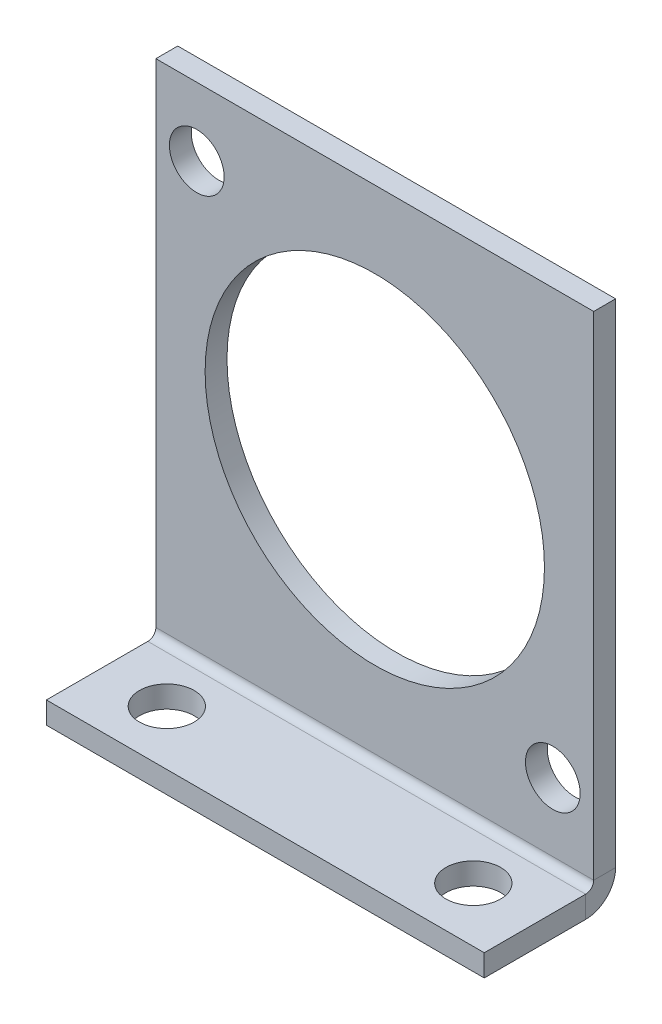
ISO-10303-21;
HEADER;
FILE_DESCRIPTION(('STEP AP214'),'2;1');
FILE_NAME('part.step','',(''),(''),'','','');
FILE_SCHEMA(('AUTOMOTIVE_DESIGN { 1 0 10303 214 1 1 1 1 }'));
ENDSEC;
DATA;
#1=APPLICATION_CONTEXT('core data for automotive mechanical design processes');
#2=APPLICATION_PROTOCOL_DEFINITION('international standard','automotive_design',2000,#1);
#3=PRODUCT_CONTEXT('',#1,'mechanical');
#4=PRODUCT('Part','Part','',(#3));
#5=PRODUCT_RELATED_PRODUCT_CATEGORY('part','',(#4));
#6=PRODUCT_DEFINITION_FORMATION('','',#4);
#7=PRODUCT_DEFINITION_CONTEXT('part definition',#1,'design');
#8=PRODUCT_DEFINITION('design','',#6,#7);
#9=PRODUCT_DEFINITION_SHAPE('','',#8);
#10=(LENGTH_UNIT() NAMED_UNIT(*) SI_UNIT(.MILLI.,.METRE.));
#11=(NAMED_UNIT(*) PLANE_ANGLE_UNIT() SI_UNIT($,.RADIAN.));
#12=(NAMED_UNIT(*) SI_UNIT($,.STERADIAN.) SOLID_ANGLE_UNIT());
#13=UNCERTAINTY_MEASURE_WITH_UNIT(LENGTH_MEASURE(1.E-05),#10,'distance_accuracy_value','');
#14=(GEOMETRIC_REPRESENTATION_CONTEXT(3) GLOBAL_UNCERTAINTY_ASSIGNED_CONTEXT((#13)) GLOBAL_UNIT_ASSIGNED_CONTEXT((#10,
#11,#12)) REPRESENTATION_CONTEXT('',''));
#15=CARTESIAN_POINT('',(0.,0.,0.));
#16=DIRECTION('',(0.,0.,1.));
#17=DIRECTION('',(1.,0.,0.));
#18=AXIS2_PLACEMENT_3D('',#15,#16,#17);
#19=CARTESIAN_POINT('',(20.,22.5,-2.));
#20=DIRECTION('',(1.,0.,0.));
#21=DIRECTION('',(0.,1.,0.));
#22=AXIS2_PLACEMENT_3D('',#19,#20,#21);
#23=PLANE('',#22);
#24=DIRECTION('',(0.,1.,0.));
#25=VECTOR('',#24,1.);
#26=CARTESIAN_POINT('',(20.,22.5,0.));
#27=LINE('',#26,#25);
#28=CARTESIAN_POINT('',(20.,-22.5,0.));
#29=VERTEX_POINT('',#28);
#30=CARTESIAN_POINT('',(20.,22.5,0.));
#31=VERTEX_POINT('',#30);
#32=EDGE_CURVE('E105',#29,#31,#27,.T.);
#33=ORIENTED_EDGE('',*,*,#32,.F.);
#34=DIRECTION('',(0.,0.,1.));
#35=VECTOR('',#34,1.);
#36=CARTESIAN_POINT('',(20.,-22.5,-2.));
#37=LINE('',#36,#35);
#38=CARTESIAN_POINT('',(20.,-22.5,-2.));
#39=VERTEX_POINT('',#38);
#40=EDGE_CURVE('E13',#39,#29,#37,.T.);
#41=ORIENTED_EDGE('',*,*,#40,.F.);
#42=DIRECTION('',(0.,1.,0.));
#43=VECTOR('',#42,1.);
#44=CARTESIAN_POINT('',(20.,22.5,-2.));
#45=LINE('',#44,#43);
#46=CARTESIAN_POINT('',(20.,22.5,-2.));
#47=VERTEX_POINT('',#46);
#48=EDGE_CURVE('E240',#39,#47,#45,.T.);
#49=ORIENTED_EDGE('',*,*,#48,.T.);
#50=DIRECTION('',(0.,0.,1.));
#51=VECTOR('',#50,1.);
#52=CARTESIAN_POINT('',(20.,22.5,-2.));
#53=LINE('',#52,#51);
#54=EDGE_CURVE('E111',#47,#31,#53,.T.);
#55=ORIENTED_EDGE('',*,*,#54,.T.);
#56=EDGE_LOOP('',(#33,#41,#49,#55));
#57=FACE_BOUND('',#56,.T.);
#58=ADVANCED_FACE('F66',(#57),#23,.T.);
#59=CARTESIAN_POINT('',(-20.,22.5,-2.));
#60=DIRECTION('',(-1.,0.,0.));
#61=DIRECTION('',(0.,-1.,0.));
#62=AXIS2_PLACEMENT_3D('',#59,#60,#61);
#63=PLANE('',#62);
#64=DIRECTION('',(0.,-1.,0.));
#65=VECTOR('',#64,1.);
#66=CARTESIAN_POINT('',(-20.,22.5,0.));
#67=LINE('',#66,#65);
#68=CARTESIAN_POINT('',(-20.,22.5,0.));
#69=VERTEX_POINT('',#68);
#70=CARTESIAN_POINT('',(-20.,-22.5,0.));
#71=VERTEX_POINT('',#70);
#72=EDGE_CURVE('E258',#69,#71,#67,.T.);
#73=ORIENTED_EDGE('',*,*,#72,.F.);
#74=DIRECTION('',(0.,0.,1.));
#75=VECTOR('',#74,1.);
#76=CARTESIAN_POINT('',(-20.,22.5,-2.));
#77=LINE('',#76,#75);
#78=CARTESIAN_POINT('',(-20.,22.5,-2.));
#79=VERTEX_POINT('',#78);
#80=EDGE_CURVE('E265',#79,#69,#77,.T.);
#81=ORIENTED_EDGE('',*,*,#80,.F.);
#82=DIRECTION('',(0.,-1.,0.));
#83=VECTOR('',#82,1.);
#84=CARTESIAN_POINT('',(-20.,22.5,-2.));
#85=LINE('',#84,#83);
#86=CARTESIAN_POINT('',(-20.,-22.5,-2.));
#87=VERTEX_POINT('',#86);
#88=EDGE_CURVE('E85',#79,#87,#85,.T.);
#89=ORIENTED_EDGE('',*,*,#88,.T.);
#90=DIRECTION('',(0.,0.,1.));
#91=VECTOR('',#90,1.);
#92=CARTESIAN_POINT('',(-20.,-22.5,-2.));
#93=LINE('',#92,#91);
#94=EDGE_CURVE('E76',#87,#71,#93,.T.);
#95=ORIENTED_EDGE('',*,*,#94,.T.);
#96=EDGE_LOOP('',(#73,#81,#89,#95));
#97=FACE_BOUND('',#96,.T.);
#98=ADVANCED_FACE('F308',(#97),#63,.T.);
#99=CARTESIAN_POINT('',(-20.,22.5,-2.));
#100=DIRECTION('',(0.,1.,0.));
#101=DIRECTION('',(0.,0.,1.));
#102=AXIS2_PLACEMENT_3D('',#99,#100,#101);
#103=PLANE('',#102);
#104=DIRECTION('',(-1.,0.,0.));
#105=VECTOR('',#104,1.);
#106=CARTESIAN_POINT('',(-20.,22.5,0.));
#107=LINE('',#106,#105);
#108=EDGE_CURVE('E254',#31,#69,#107,.T.);
#109=ORIENTED_EDGE('',*,*,#108,.F.);
#110=ORIENTED_EDGE('',*,*,#54,.F.);
#111=DIRECTION('',(-1.,0.,0.));
#112=VECTOR('',#111,1.);
#113=CARTESIAN_POINT('',(-20.,22.5,-2.));
#114=LINE('',#113,#112);
#115=EDGE_CURVE('E244',#47,#79,#114,.T.);
#116=ORIENTED_EDGE('',*,*,#115,.T.);
#117=ORIENTED_EDGE('',*,*,#80,.T.);
#118=EDGE_LOOP('',(#109,#110,#116,#117));
#119=FACE_BOUND('',#118,.T.);
#120=ADVANCED_FACE('F307',(#119),#103,.T.);
#121=CARTESIAN_POINT('',(0.,0.,-2.));
#122=DIRECTION('',(0.,0.,1.));
#123=DIRECTION('',(1.,0.,0.));
#124=AXIS2_PLACEMENT_3D('',#121,#122,#123);
#125=PLANE('',#124);
#126=CARTESIAN_POINT('',(-16.2634559672906,16.2634559672906,-2.));
#127=DIRECTION('',(0.,0.,1.));
#128=DIRECTION('',(1.,0.,0.));
#129=AXIS2_PLACEMENT_3D('',#126,#127,#128);
#130=CIRCLE('',#129,2.5);
#131=CARTESIAN_POINT('',(-13.7634559672906,16.2634559672906,-2.));
#132=VERTEX_POINT('',#131);
#133=EDGE_CURVE('E217',#132,#132,#130,.T.);
#134=ORIENTED_EDGE('',*,*,#133,.T.);
#135=EDGE_LOOP('',(#134));
#136=FACE_BOUND('',#135,.T.);
#137=CARTESIAN_POINT('',(16.2634559672906,-16.2634559672906,-2.));
#138=DIRECTION('',(0.,0.,1.));
#139=DIRECTION('',(1.,0.,0.));
#140=AXIS2_PLACEMENT_3D('',#137,#138,#139);
#141=CIRCLE('',#140,2.5);
#142=CARTESIAN_POINT('',(18.7634559672906,-16.2634559672906,-2.));
#143=VERTEX_POINT('',#142);
#144=EDGE_CURVE('E210',#143,#143,#141,.T.);
#145=ORIENTED_EDGE('',*,*,#144,.T.);
#146=EDGE_LOOP('',(#145));
#147=FACE_BOUND('',#146,.T.);
#148=CARTESIAN_POINT('',(0.,0.,-2.));
#149=DIRECTION('',(0.,0.,1.));
#150=DIRECTION('',(1.,0.,0.));
#151=AXIS2_PLACEMENT_3D('',#148,#149,#150);
#152=CIRCLE('',#151,15.5);
#153=CARTESIAN_POINT('',(15.5,0.,-2.));
#154=VERTEX_POINT('',#153);
#155=EDGE_CURVE('E233',#154,#154,#152,.T.);
#156=ORIENTED_EDGE('',*,*,#155,.T.);
#157=EDGE_LOOP('',(#156));
#158=FACE_BOUND('',#157,.T.);
#159=ORIENTED_EDGE('',*,*,#48,.F.);
#160=DIRECTION('',(1.,0.,0.));
#161=VECTOR('',#160,1.);
#162=CARTESIAN_POINT('',(-20.,-22.5,-2.));
#163=LINE('',#162,#161);
#164=EDGE_CURVE('E149',#87,#39,#163,.T.);
#165=ORIENTED_EDGE('',*,*,#164,.F.);
#166=ORIENTED_EDGE('',*,*,#88,.F.);
#167=ORIENTED_EDGE('',*,*,#115,.F.);
#168=EDGE_LOOP('',(#159,#165,#166,#167));
#169=FACE_BOUND('',#168,.T.);
#170=ADVANCED_FACE('F306',(#136,#147,#158,#169),#125,.F.);
#171=CARTESIAN_POINT('',(0.,0.,0.));
#172=DIRECTION('',(0.,0.,1.));
#173=DIRECTION('',(1.,0.,0.));
#174=AXIS2_PLACEMENT_3D('',#171,#172,#173);
#175=PLANE('',#174);
#176=CARTESIAN_POINT('',(-16.2634559672906,16.2634559672906,0.));
#177=DIRECTION('',(0.,0.,1.));
#178=DIRECTION('',(1.,0.,0.));
#179=AXIS2_PLACEMENT_3D('',#176,#177,#178);
#180=CIRCLE('',#179,2.5);
#181=CARTESIAN_POINT('',(-13.7634559672906,16.2634559672906,0.));
#182=VERTEX_POINT('',#181);
#183=EDGE_CURVE('E222',#182,#182,#180,.T.);
#184=ORIENTED_EDGE('',*,*,#183,.F.);
#185=EDGE_LOOP('',(#184));
#186=FACE_BOUND('',#185,.T.);
#187=CARTESIAN_POINT('',(16.2634559672906,-16.2634559672906,0.));
#188=DIRECTION('',(0.,0.,1.));
#189=DIRECTION('',(1.,0.,0.));
#190=AXIS2_PLACEMENT_3D('',#187,#188,#189);
#191=CIRCLE('',#190,2.5);
#192=CARTESIAN_POINT('',(18.7634559672906,-16.2634559672906,0.));
#193=VERTEX_POINT('',#192);
#194=EDGE_CURVE('E226',#193,#193,#191,.T.);
#195=ORIENTED_EDGE('',*,*,#194,.F.);
#196=EDGE_LOOP('',(#195));
#197=FACE_BOUND('',#196,.T.);
#198=CARTESIAN_POINT('',(0.,0.,0.));
#199=DIRECTION('',(0.,0.,1.));
#200=DIRECTION('',(1.,0.,0.));
#201=AXIS2_PLACEMENT_3D('',#198,#199,#200);
#202=CIRCLE('',#201,15.5);
#203=CARTESIAN_POINT('',(15.5,0.,0.));
#204=VERTEX_POINT('',#203);
#205=EDGE_CURVE('E221',#204,#204,#202,.T.);
#206=ORIENTED_EDGE('',*,*,#205,.F.);
#207=EDGE_LOOP('',(#206));
#208=FACE_BOUND('',#207,.T.);
#209=ORIENTED_EDGE('',*,*,#32,.T.);
#210=ORIENTED_EDGE('',*,*,#108,.T.);
#211=ORIENTED_EDGE('',*,*,#72,.T.);
#212=DIRECTION('',(1.,0.,0.));
#213=VECTOR('',#212,1.);
#214=CARTESIAN_POINT('',(-20.,-22.5,0.));
#215=LINE('',#214,#213);
#216=EDGE_CURVE('E245',#71,#29,#215,.T.);
#217=ORIENTED_EDGE('',*,*,#216,.T.);
#218=EDGE_LOOP('',(#209,#210,#211,#217));
#219=FACE_BOUND('',#218,.T.);
#220=ADVANCED_FACE('F304',(#186,#197,#208,#219),#175,.T.);
#221=CARTESIAN_POINT('',(0.,0.,-2.));
#222=DIRECTION('',(0.,0.,1.));
#223=DIRECTION('',(1.,0.,0.));
#224=AXIS2_PLACEMENT_3D('',#221,#222,#223);
#225=CYLINDRICAL_SURFACE('',#224,15.5);
#226=ORIENTED_EDGE('',*,*,#155,.F.);
#227=EDGE_LOOP('',(#226));
#228=FACE_BOUND('',#227,.T.);
#229=ORIENTED_EDGE('',*,*,#205,.T.);
#230=EDGE_LOOP('',(#229));
#231=FACE_BOUND('',#230,.T.);
#232=ADVANCED_FACE('F319',(#228,#231),#225,.F.);
#233=CARTESIAN_POINT('',(16.2634559672906,-16.2634559672906,-2.));
#234=DIRECTION('',(0.,0.,1.));
#235=DIRECTION('',(1.,0.,0.));
#236=AXIS2_PLACEMENT_3D('',#233,#234,#235);
#237=CYLINDRICAL_SURFACE('',#236,2.5);
#238=ORIENTED_EDGE('',*,*,#144,.F.);
#239=EDGE_LOOP('',(#238));
#240=FACE_BOUND('',#239,.T.);
#241=ORIENTED_EDGE('',*,*,#194,.T.);
#242=EDGE_LOOP('',(#241));
#243=FACE_BOUND('',#242,.T.);
#244=ADVANCED_FACE('F325',(#240,#243),#237,.F.);
#245=CARTESIAN_POINT('',(-16.2634559672906,16.2634559672906,-2.));
#246=DIRECTION('',(0.,0.,1.));
#247=DIRECTION('',(1.,0.,0.));
#248=AXIS2_PLACEMENT_3D('',#245,#246,#247);
#249=CYLINDRICAL_SURFACE('',#248,2.5);
#250=ORIENTED_EDGE('',*,*,#133,.F.);
#251=EDGE_LOOP('',(#250));
#252=FACE_BOUND('',#251,.T.);
#253=ORIENTED_EDGE('',*,*,#183,.T.);
#254=EDGE_LOOP('',(#253));
#255=FACE_BOUND('',#254,.T.);
#256=ADVANCED_FACE('F329',(#252,#255),#249,.F.);
#257=CARTESIAN_POINT('',(-20.,-22.5,0.7366));
#258=DIRECTION('',(-1.,0.,0.));
#259=DIRECTION('',(0.,0.,1.));
#260=AXIS2_PLACEMENT_3D('',#257,#258,#259);
#261=PLANE('',#260);
#262=DIRECTION('',(0.,-1.,0.));
#263=VECTOR('',#262,1.);
#264=CARTESIAN_POINT('',(-20.,-25.2366,0.73659999999999));
#265=LINE('',#264,#263);
#266=CARTESIAN_POINT('',(-20.,-23.2366,0.736599999999997));
#267=VERTEX_POINT('',#266);
#268=CARTESIAN_POINT('',(-20.,-25.2366,0.73659999999999));
#269=VERTEX_POINT('',#268);
#270=EDGE_CURVE('E205',#267,#269,#265,.T.);
#271=ORIENTED_EDGE('',*,*,#270,.F.);
#272=CARTESIAN_POINT('',(-20.,-22.5,0.7366));
#273=DIRECTION('',(1.,0.,0.));
#274=DIRECTION('',(0.,0.,-1.));
#275=AXIS2_PLACEMENT_3D('',#272,#273,#274);
#276=CIRCLE('',#275,0.7366);
#277=EDGE_CURVE('E153',#71,#267,#276,.F.);
#278=ORIENTED_EDGE('',*,*,#277,.F.);
#279=ORIENTED_EDGE('',*,*,#94,.F.);
#280=CARTESIAN_POINT('',(-20.,-22.5,0.7366));
#281=DIRECTION('',(1.,0.,0.));
#282=DIRECTION('',(0.,0.,-1.));
#283=AXIS2_PLACEMENT_3D('',#280,#281,#282);
#284=CIRCLE('',#283,2.7366);
#285=EDGE_CURVE('E152',#87,#269,#284,.F.);
#286=ORIENTED_EDGE('',*,*,#285,.T.);
#287=EDGE_LOOP('',(#271,#278,#279,#286));
#288=FACE_BOUND('',#287,.T.);
#289=ADVANCED_FACE('F299',(#288),#261,.T.);
#290=CARTESIAN_POINT('',(20.,-22.5,0.7366));
#291=DIRECTION('',(-1.,0.,0.));
#292=DIRECTION('',(0.,0.,1.));
#293=AXIS2_PLACEMENT_3D('',#290,#291,#292);
#294=PLANE('',#293);
#295=CARTESIAN_POINT('',(20.,-22.5,0.7366));
#296=DIRECTION('',(1.,0.,0.));
#297=DIRECTION('',(0.,0.,-1.));
#298=AXIS2_PLACEMENT_3D('',#295,#296,#297);
#299=CIRCLE('',#298,0.7366);
#300=CARTESIAN_POINT('',(20.,-23.2366,0.736599999999997));
#301=VERTEX_POINT('',#300);
#302=EDGE_CURVE('E160',#301,#29,#299,.T.);
#303=ORIENTED_EDGE('',*,*,#302,.F.);
#304=DIRECTION('',(0.,-1.,0.));
#305=VECTOR('',#304,1.);
#306=CARTESIAN_POINT('',(20.,-23.2366,0.736599999999997));
#307=LINE('',#306,#305);
#308=CARTESIAN_POINT('',(20.,-25.2366,0.73659999999999));
#309=VERTEX_POINT('',#308);
#310=EDGE_CURVE('E157',#301,#309,#307,.T.);
#311=ORIENTED_EDGE('',*,*,#310,.T.);
#312=CARTESIAN_POINT('',(20.,-22.5,0.7366));
#313=DIRECTION('',(1.,0.,0.));
#314=DIRECTION('',(0.,0.,-1.));
#315=AXIS2_PLACEMENT_3D('',#312,#313,#314);
#316=CIRCLE('',#315,2.7366);
#317=EDGE_CURVE('E142',#309,#39,#316,.T.);
#318=ORIENTED_EDGE('',*,*,#317,.T.);
#319=ORIENTED_EDGE('',*,*,#40,.T.);
#320=EDGE_LOOP('',(#303,#311,#318,#319));
#321=FACE_BOUND('',#320,.T.);
#322=ADVANCED_FACE('F158',(#321),#294,.F.);
#323=CARTESIAN_POINT('',(20.,-22.5,0.7366));
#324=DIRECTION('',(1.,0.,0.));
#325=DIRECTION('',(0.,-1.,0.));
#326=AXIS2_PLACEMENT_3D('',#323,#324,#325);
#327=CYLINDRICAL_SURFACE('',#326,2.7366);
#328=ORIENTED_EDGE('',*,*,#164,.T.);
#329=ORIENTED_EDGE('',*,*,#317,.F.);
#330=DIRECTION('',(1.,0.,0.));
#331=VECTOR('',#330,1.);
#332=CARTESIAN_POINT('',(0.,-25.2366,0.73659999999999));
#333=LINE('',#332,#331);
#334=EDGE_CURVE('E147',#269,#309,#333,.T.);
#335=ORIENTED_EDGE('',*,*,#334,.F.);
#336=ORIENTED_EDGE('',*,*,#285,.F.);
#337=EDGE_LOOP('',(#328,#329,#335,#336));
#338=FACE_BOUND('',#337,.T.);
#339=ADVANCED_FACE('F144',(#338),#327,.T.);
#340=CARTESIAN_POINT('',(20.,-22.5,0.7366));
#341=DIRECTION('',(1.,0.,0.));
#342=DIRECTION('',(0.,-1.,0.));
#343=AXIS2_PLACEMENT_3D('',#340,#341,#342);
#344=CYLINDRICAL_SURFACE('',#343,0.7366);
#345=ORIENTED_EDGE('',*,*,#216,.F.);
#346=ORIENTED_EDGE('',*,*,#277,.T.);
#347=DIRECTION('',(-1.,0.,0.));
#348=VECTOR('',#347,1.);
#349=CARTESIAN_POINT('',(-20.,-23.2366,0.736599999999997));
#350=LINE('',#349,#348);
#351=EDGE_CURVE('E166',#267,#301,#350,.F.);
#352=ORIENTED_EDGE('',*,*,#351,.T.);
#353=ORIENTED_EDGE('',*,*,#302,.T.);
#354=EDGE_LOOP('',(#345,#346,#352,#353));
#355=FACE_BOUND('',#354,.T.);
#356=ADVANCED_FACE('F302',(#355),#344,.F.);
#357=CARTESIAN_POINT('',(20.,-25.2366,0.));
#358=DIRECTION('',(1.,0.,0.));
#359=DIRECTION('',(0.,0.,-1.));
#360=AXIS2_PLACEMENT_3D('',#357,#358,#359);
#361=PLANE('',#360);
#362=DIRECTION('',(0.,0.,-1.));
#363=VECTOR('',#362,1.);
#364=CARTESIAN_POINT('',(20.,-25.2366,0.));
#365=LINE('',#364,#363);
#366=CARTESIAN_POINT('',(20.,-25.2366,10.));
#367=VERTEX_POINT('',#366);
#368=EDGE_CURVE('E173',#367,#309,#365,.T.);
#369=ORIENTED_EDGE('',*,*,#368,.T.);
#370=ORIENTED_EDGE('',*,*,#310,.F.);
#371=DIRECTION('',(0.,0.,1.));
#372=VECTOR('',#371,1.);
#373=CARTESIAN_POINT('',(20.,-23.2366,0.));
#374=LINE('',#373,#372);
#375=CARTESIAN_POINT('',(20.,-23.2366,10.));
#376=VERTEX_POINT('',#375);
#377=EDGE_CURVE('E194',#376,#301,#374,.F.);
#378=ORIENTED_EDGE('',*,*,#377,.F.);
#379=DIRECTION('',(0.,1.,0.));
#380=VECTOR('',#379,1.);
#381=CARTESIAN_POINT('',(20.,-25.2366,10.));
#382=LINE('',#381,#380);
#383=EDGE_CURVE('E179',#367,#376,#382,.T.);
#384=ORIENTED_EDGE('',*,*,#383,.F.);
#385=EDGE_LOOP('',(#369,#370,#378,#384));
#386=FACE_BOUND('',#385,.T.);
#387=ADVANCED_FACE('F178',(#386),#361,.T.);
#388=CARTESIAN_POINT('',(-20.,-25.2366,10.));
#389=DIRECTION('',(-1.,0.,0.));
#390=DIRECTION('',(0.,0.,1.));
#391=AXIS2_PLACEMENT_3D('',#388,#389,#390);
#392=PLANE('',#391);
#393=DIRECTION('',(0.,0.,-1.));
#394=VECTOR('',#393,1.);
#395=CARTESIAN_POINT('',(-20.,-23.2366,0.));
#396=LINE('',#395,#394);
#397=CARTESIAN_POINT('',(-20.,-23.2366,10.));
#398=VERTEX_POINT('',#397);
#399=EDGE_CURVE('E176',#267,#398,#396,.F.);
#400=ORIENTED_EDGE('',*,*,#399,.F.);
#401=ORIENTED_EDGE('',*,*,#270,.T.);
#402=DIRECTION('',(0.,0.,1.));
#403=VECTOR('',#402,1.);
#404=CARTESIAN_POINT('',(-20.,-25.2366,10.));
#405=LINE('',#404,#403);
#406=CARTESIAN_POINT('',(-20.,-25.2366,10.));
#407=VERTEX_POINT('',#406);
#408=EDGE_CURVE('E174',#269,#407,#405,.T.);
#409=ORIENTED_EDGE('',*,*,#408,.T.);
#410=DIRECTION('',(0.,1.,0.));
#411=VECTOR('',#410,1.);
#412=CARTESIAN_POINT('',(-20.,-25.2366,10.));
#413=LINE('',#412,#411);
#414=EDGE_CURVE('E182',#407,#398,#413,.T.);
#415=ORIENTED_EDGE('',*,*,#414,.T.);
#416=EDGE_LOOP('',(#400,#401,#409,#415));
#417=FACE_BOUND('',#416,.T.);
#418=ADVANCED_FACE('F296',(#417),#392,.T.);
#419=CARTESIAN_POINT('',(0.,-25.2366,0.));
#420=DIRECTION('',(0.,-1.,0.));
#421=DIRECTION('',(0.,0.,-1.));
#422=AXIS2_PLACEMENT_3D('',#419,#420,#421);
#423=PLANE('',#422);
#424=CARTESIAN_POINT('',(-14.,-25.2366,5.));
#425=DIRECTION('',(0.,-1.,0.));
#426=DIRECTION('',(0.,0.,-1.));
#427=AXIS2_PLACEMENT_3D('',#424,#425,#426);
#428=CIRCLE('',#427,2.5);
#429=CARTESIAN_POINT('',(-14.,-25.2366,2.5));
#430=VERTEX_POINT('',#429);
#431=EDGE_CURVE('E272',#430,#430,#428,.T.);
#432=ORIENTED_EDGE('',*,*,#431,.F.);
#433=EDGE_LOOP('',(#432));
#434=FACE_BOUND('',#433,.T.);
#435=CARTESIAN_POINT('',(14.,-25.2366,5.));
#436=DIRECTION('',(0.,-1.,0.));
#437=DIRECTION('',(0.,0.,-1.));
#438=AXIS2_PLACEMENT_3D('',#435,#436,#437);
#439=CIRCLE('',#438,2.5);
#440=CARTESIAN_POINT('',(14.,-25.2366,2.5));
#441=VERTEX_POINT('',#440);
#442=EDGE_CURVE('E279',#441,#441,#439,.T.);
#443=ORIENTED_EDGE('',*,*,#442,.F.);
#444=EDGE_LOOP('',(#443));
#445=FACE_BOUND('',#444,.T.);
#446=ORIENTED_EDGE('',*,*,#408,.F.);
#447=ORIENTED_EDGE('',*,*,#334,.T.);
#448=ORIENTED_EDGE('',*,*,#368,.F.);
#449=DIRECTION('',(1.,0.,0.));
#450=VECTOR('',#449,1.);
#451=CARTESIAN_POINT('',(20.,-25.2366,10.));
#452=LINE('',#451,#450);
#453=EDGE_CURVE('E183',#407,#367,#452,.T.);
#454=ORIENTED_EDGE('',*,*,#453,.F.);
#455=EDGE_LOOP('',(#446,#447,#448,#454));
#456=FACE_BOUND('',#455,.T.);
#457=ADVANCED_FACE('F171',(#434,#445,#456),#423,.T.);
#458=CARTESIAN_POINT('',(0.,-23.2366,0.));
#459=DIRECTION('',(0.,-1.,0.));
#460=DIRECTION('',(0.,0.,-1.));
#461=AXIS2_PLACEMENT_3D('',#458,#459,#460);
#462=PLANE('',#461);
#463=CARTESIAN_POINT('',(-14.,-23.2366,5.00000000000001));
#464=DIRECTION('',(0.,-1.,0.));
#465=DIRECTION('',(0.,0.,-1.));
#466=AXIS2_PLACEMENT_3D('',#463,#464,#465);
#467=CIRCLE('',#466,2.5);
#468=CARTESIAN_POINT('',(-14.,-23.2366,2.50000000000001));
#469=VERTEX_POINT('',#468);
#470=EDGE_CURVE('E69',#469,#469,#467,.T.);
#471=ORIENTED_EDGE('',*,*,#470,.T.);
#472=EDGE_LOOP('',(#471));
#473=FACE_BOUND('',#472,.T.);
#474=CARTESIAN_POINT('',(14.,-23.2366,5.00000000000001));
#475=DIRECTION('',(0.,-1.,0.));
#476=DIRECTION('',(0.,0.,-1.));
#477=AXIS2_PLACEMENT_3D('',#474,#475,#476);
#478=CIRCLE('',#477,2.5);
#479=CARTESIAN_POINT('',(14.,-23.2366,2.50000000000001));
#480=VERTEX_POINT('',#479);
#481=EDGE_CURVE('E269',#480,#480,#478,.T.);
#482=ORIENTED_EDGE('',*,*,#481,.T.);
#483=EDGE_LOOP('',(#482));
#484=FACE_BOUND('',#483,.T.);
#485=ORIENTED_EDGE('',*,*,#351,.F.);
#486=ORIENTED_EDGE('',*,*,#399,.T.);
#487=DIRECTION('',(-1.,0.,0.));
#488=VECTOR('',#487,1.);
#489=CARTESIAN_POINT('',(0.,-23.2366,10.));
#490=LINE('',#489,#488);
#491=EDGE_CURVE('E197',#398,#376,#490,.F.);
#492=ORIENTED_EDGE('',*,*,#491,.T.);
#493=ORIENTED_EDGE('',*,*,#377,.T.);
#494=EDGE_LOOP('',(#485,#486,#492,#493));
#495=FACE_BOUND('',#494,.T.);
#496=ADVANCED_FACE('F293',(#473,#484,#495),#462,.F.);
#497=CARTESIAN_POINT('',(20.,-25.2366,10.));
#498=DIRECTION('',(0.,0.,1.));
#499=DIRECTION('',(0.,-1.,0.));
#500=AXIS2_PLACEMENT_3D('',#497,#498,#499);
#501=PLANE('',#500);
#502=ORIENTED_EDGE('',*,*,#491,.F.);
#503=ORIENTED_EDGE('',*,*,#414,.F.);
#504=ORIENTED_EDGE('',*,*,#453,.T.);
#505=ORIENTED_EDGE('',*,*,#383,.T.);
#506=EDGE_LOOP('',(#502,#503,#504,#505));
#507=FACE_BOUND('',#506,.T.);
#508=ADVANCED_FACE('F289',(#507),#501,.T.);
#509=CARTESIAN_POINT('',(14.,22.5,5.00000000000017));
#510=DIRECTION('',(0.,-1.,0.));
#511=DIRECTION('',(0.,0.,-1.));
#512=AXIS2_PLACEMENT_3D('',#509,#510,#511);
#513=CYLINDRICAL_SURFACE('',#512,2.5);
#514=ORIENTED_EDGE('',*,*,#442,.T.);
#515=EDGE_LOOP('',(#514));
#516=FACE_BOUND('',#515,.T.);
#517=ORIENTED_EDGE('',*,*,#481,.F.);
#518=EDGE_LOOP('',(#517));
#519=FACE_BOUND('',#518,.T.);
#520=ADVANCED_FACE('F346',(#516,#519),#513,.F.);
#521=CARTESIAN_POINT('',(-14.,22.5,5.00000000000017));
#522=DIRECTION('',(0.,-1.,0.));
#523=DIRECTION('',(0.,0.,-1.));
#524=AXIS2_PLACEMENT_3D('',#521,#522,#523);
#525=CYLINDRICAL_SURFACE('',#524,2.5);
#526=ORIENTED_EDGE('',*,*,#431,.T.);
#527=EDGE_LOOP('',(#526));
#528=FACE_BOUND('',#527,.T.);
#529=ORIENTED_EDGE('',*,*,#470,.F.);
#530=EDGE_LOOP('',(#529));
#531=FACE_BOUND('',#530,.T.);
#532=ADVANCED_FACE('F357',(#528,#531),#525,.F.);
#533=CLOSED_SHELL('',(#58,#98,#120,#170,#220,#232,#244,#256,#289,#322,#339,#356,#387,#418,#457,
#496,#508,#520,#532));
#534=MANIFOLD_SOLID_BREP('B2',#533);
#535=ADVANCED_BREP_SHAPE_REPRESENTATION('',(#18,#534),#14);
#536=SHAPE_DEFINITION_REPRESENTATION(#9,#535);
ENDSEC;
END-ISO-10303-21;
